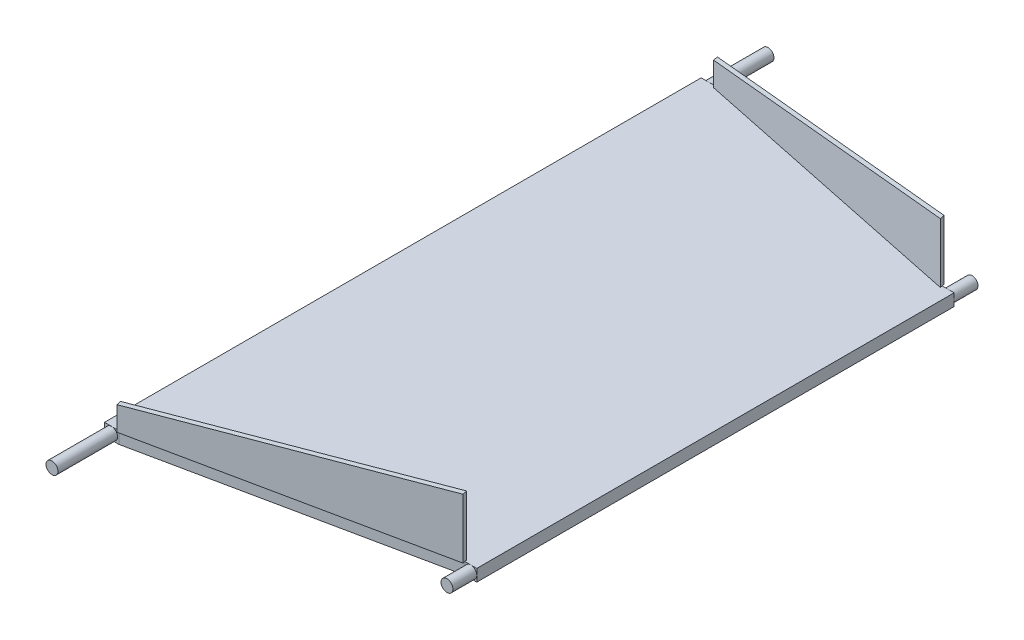
ISO-10303-21;
HEADER;
FILE_DESCRIPTION(('STEP AP214'),'2;1');
FILE_NAME('part.step','',(''),(''),'','','');
FILE_SCHEMA(('AUTOMOTIVE_DESIGN { 1 0 10303 214 1 1 1 1 }'));
ENDSEC;
DATA;
#1=APPLICATION_CONTEXT('core data for automotive mechanical design processes');
#2=APPLICATION_PROTOCOL_DEFINITION('international standard','automotive_design',2000,#1);
#3=PRODUCT_CONTEXT('',#1,'mechanical');
#4=PRODUCT('Part','Part','',(#3));
#5=PRODUCT_RELATED_PRODUCT_CATEGORY('part','',(#4));
#6=PRODUCT_DEFINITION_FORMATION('','',#4);
#7=PRODUCT_DEFINITION_CONTEXT('part definition',#1,'design');
#8=PRODUCT_DEFINITION('design','',#6,#7);
#9=PRODUCT_DEFINITION_SHAPE('','',#8);
#10=(LENGTH_UNIT() NAMED_UNIT(*) SI_UNIT(.MILLI.,.METRE.));
#11=(NAMED_UNIT(*) PLANE_ANGLE_UNIT() SI_UNIT($,.RADIAN.));
#12=(NAMED_UNIT(*) SI_UNIT($,.STERADIAN.) SOLID_ANGLE_UNIT());
#13=UNCERTAINTY_MEASURE_WITH_UNIT(LENGTH_MEASURE(1.E-05),#10,'distance_accuracy_value','');
#14=(GEOMETRIC_REPRESENTATION_CONTEXT(3) GLOBAL_UNCERTAINTY_ASSIGNED_CONTEXT((#13)) GLOBAL_UNIT_ASSIGNED_CONTEXT((#10,
#11,#12)) REPRESENTATION_CONTEXT('',''));
#15=CARTESIAN_POINT('',(0.,0.,0.));
#16=DIRECTION('',(0.,0.,1.));
#17=DIRECTION('',(1.,0.,0.));
#18=AXIS2_PLACEMENT_3D('',#15,#16,#17);
#19=CARTESIAN_POINT('',(0.,5.,0.));
#20=DIRECTION('',(0.,1.,0.));
#21=DIRECTION('',(0.,0.,1.));
#22=AXIS2_PLACEMENT_3D('',#19,#20,#21);
#23=PLANE('',#22);
#24=DIRECTION('',(0.978980419737605,0.,0.203954254112001));
#25=VECTOR('',#24,1.);
#26=CARTESIAN_POINT('',(-246.702913096708,5.,-101.869944420954));
#27=LINE('',#26,#25);
#28=CARTESIAN_POINT('',(-246.702913096708,5.,-101.869944420953));
#29=VERTEX_POINT('',#28);
#30=CARTESIAN_POINT('',(-126.702913096708,5.,-76.8699444209535));
#31=VERTEX_POINT('',#30);
#32=EDGE_CURVE('E62',#29,#31,#27,.T.);
#33=ORIENTED_EDGE('',*,*,#32,.F.);
#34=DIRECTION('',(0.203954254112001,0.,0.978980419737605));
#35=VECTOR('',#34,1.);
#36=CARTESIAN_POINT('',(-247.110821604932,5.,-103.827905260429));
#37=LINE('',#36,#35);
#38=CARTESIAN_POINT('',(-246.90686735082,5.,-102.848924840691));
#39=VERTEX_POINT('',#38);
#40=EDGE_CURVE('E237',#39,#29,#37,.T.);
#41=ORIENTED_EDGE('',*,*,#40,.F.);
#42=DIRECTION('',(-1.,0.,0.));
#43=VECTOR('',#42,1.);
#44=CARTESIAN_POINT('',(-246.90686735082,5.,-102.848924840691));
#45=LINE('',#44,#43);
#46=CARTESIAN_POINT('',(-249.90686735082,5.,-102.848924840691));
#47=VERTEX_POINT('',#46);
#48=EDGE_CURVE('E452',#39,#47,#45,.T.);
#49=ORIENTED_EDGE('',*,*,#48,.T.);
#50=CARTESIAN_POINT('',(-252.90686735082,5.,-102.848924840691));
#51=VERTEX_POINT('',#50);
#52=EDGE_CURVE('E449',#47,#51,#45,.T.);
#53=ORIENTED_EDGE('',*,*,#52,.T.);
#54=DIRECTION('',(0.,0.,1.));
#55=VECTOR('',#54,1.);
#56=CARTESIAN_POINT('',(-252.90686735082,5.,-102.848924840691));
#57=LINE('',#56,#55);
#58=CARTESIAN_POINT('',(-252.90686735082,5.,147.151075159309));
#59=VERTEX_POINT('',#58);
#60=EDGE_CURVE('E437',#51,#59,#57,.T.);
#61=ORIENTED_EDGE('',*,*,#60,.T.);
#62=DIRECTION('',(-1.,0.,0.));
#63=VECTOR('',#62,1.);
#64=CARTESIAN_POINT('',(-246.90686735082,5.,147.151075159309));
#65=LINE('',#64,#63);
#66=CARTESIAN_POINT('',(-249.90686735082,5.,147.151075159309));
#67=VERTEX_POINT('',#66);
#68=EDGE_CURVE('E420',#67,#59,#65,.T.);
#69=ORIENTED_EDGE('',*,*,#68,.F.);
#70=CARTESIAN_POINT('',(-246.90686735082,5.,147.151075159309));
#71=VERTEX_POINT('',#70);
#72=EDGE_CURVE('E423',#71,#67,#65,.T.);
#73=ORIENTED_EDGE('',*,*,#72,.F.);
#74=DIRECTION('',(0.203954254112001,0.,0.978980419737605));
#75=VECTOR('',#74,1.);
#76=CARTESIAN_POINT('',(-247.110821604932,5.,146.172094739571));
#77=LINE('',#76,#75);
#78=CARTESIAN_POINT('',(-247.110821604932,5.,146.172094739571));
#79=VERTEX_POINT('',#78);
#80=EDGE_CURVE('E242',#79,#71,#77,.T.);
#81=ORIENTED_EDGE('',*,*,#80,.F.);
#82=DIRECTION('',(0.978980419737605,0.,-0.203954254112001));
#83=VECTOR('',#82,1.);
#84=CARTESIAN_POINT('',(-247.110821604932,5.,146.172094739571));
#85=LINE('',#84,#83);
#86=CARTESIAN_POINT('',(-127.110821604932,5.,121.172094739571));
#87=VERTEX_POINT('',#86);
#88=EDGE_CURVE('E335',#79,#87,#85,.T.);
#89=ORIENTED_EDGE('',*,*,#88,.T.);
#90=DIRECTION('',(0.203954254112001,0.,0.978980419737605));
#91=VECTOR('',#90,1.);
#92=CARTESIAN_POINT('',(-127.110821604932,5.,121.172094739571));
#93=LINE('',#92,#91);
#94=CARTESIAN_POINT('',(-126.90686735082,5.,122.151075159309));
#95=VERTEX_POINT('',#94);
#96=EDGE_CURVE('E325',#87,#95,#93,.T.);
#97=ORIENTED_EDGE('',*,*,#96,.T.);
#98=DIRECTION('',(1.,0.,0.));
#99=VECTOR('',#98,1.);
#100=CARTESIAN_POINT('',(-126.90686735082,5.,122.151075159309));
#101=LINE('',#100,#99);
#102=CARTESIAN_POINT('',(-124.40686735082,5.,122.151075159309));
#103=VERTEX_POINT('',#102);
#104=EDGE_CURVE('E363',#95,#103,#101,.T.);
#105=ORIENTED_EDGE('',*,*,#104,.T.);
#106=CARTESIAN_POINT('',(-121.90686735082,5.,122.151075159309));
#107=VERTEX_POINT('',#106);
#108=EDGE_CURVE('E360',#103,#107,#101,.T.);
#109=ORIENTED_EDGE('',*,*,#108,.T.);
#110=DIRECTION('',(0.,0.,1.));
#111=VECTOR('',#110,1.);
#112=CARTESIAN_POINT('',(-121.90686735082,5.,122.151075159309));
#113=LINE('',#112,#111);
#114=CARTESIAN_POINT('',(-121.90686735082,5.,-77.8489248406911));
#115=VERTEX_POINT('',#114);
#116=EDGE_CURVE('E374',#115,#107,#113,.T.);
#117=ORIENTED_EDGE('',*,*,#116,.F.);
#118=DIRECTION('',(1.,0.,0.));
#119=VECTOR('',#118,1.);
#120=CARTESIAN_POINT('',(-126.90686735082,5.,-77.8489248406911));
#121=LINE('',#120,#119);
#122=CARTESIAN_POINT('',(-124.40686735082,5.,-77.8489248406911));
#123=VERTEX_POINT('',#122);
#124=EDGE_CURVE('E378',#123,#115,#121,.T.);
#125=ORIENTED_EDGE('',*,*,#124,.F.);
#126=CARTESIAN_POINT('',(-126.90686735082,5.,-77.8489248406911));
#127=VERTEX_POINT('',#126);
#128=EDGE_CURVE('E381',#127,#123,#121,.T.);
#129=ORIENTED_EDGE('',*,*,#128,.F.);
#130=DIRECTION('',(0.203954254112001,0.,0.978980419737605));
#131=VECTOR('',#130,1.);
#132=CARTESIAN_POINT('',(-127.110821604932,5.,-78.8279052604287));
#133=LINE('',#132,#131);
#134=EDGE_CURVE('E67',#127,#31,#133,.T.);
#135=ORIENTED_EDGE('',*,*,#134,.T.);
#136=EDGE_LOOP('',(#33,#41,#49,#53,#61,#69,#73,#81,#89,#97,#105,#109,#117,#125,#129,#135));
#137=FACE_BOUND('',#136,.T.);
#138=ADVANCED_FACE('F45',(#137),#23,.T.);
#139=CARTESIAN_POINT('',(-126.90686735082,0.,122.151075159309));
#140=DIRECTION('',(0.,0.,1.));
#141=DIRECTION('',(1.,0.,0.));
#142=AXIS2_PLACEMENT_3D('',#139,#140,#141);
#143=PLANE('',#142);
#144=DIRECTION('',(0.,-1.,0.));
#145=VECTOR('',#144,1.);
#146=CARTESIAN_POINT('',(-121.90686735082,0.,122.151075159309));
#147=LINE('',#146,#145);
#148=CARTESIAN_POINT('',(-121.90686735082,2.5,122.151075159309));
#149=VERTEX_POINT('',#148);
#150=CARTESIAN_POINT('',(-121.90686735082,0.,122.151075159309));
#151=VERTEX_POINT('',#150);
#152=EDGE_CURVE('E352',#149,#151,#147,.T.);
#153=ORIENTED_EDGE('',*,*,#152,.F.);
#154=CARTESIAN_POINT('',(-124.40686735082,2.5,122.151075159309));
#155=DIRECTION('',(0.,0.,1.));
#156=DIRECTION('',(1.,0.,0.));
#157=AXIS2_PLACEMENT_3D('',#154,#155,#156);
#158=CIRCLE('',#157,2.5);
#159=CARTESIAN_POINT('',(-124.40686735082,0.,122.151075159309));
#160=VERTEX_POINT('',#159);
#161=EDGE_CURVE('E12',#149,#160,#158,.F.);
#162=ORIENTED_EDGE('',*,*,#161,.T.);
#163=DIRECTION('',(1.,0.,0.));
#164=VECTOR('',#163,1.);
#165=CARTESIAN_POINT('',(-126.90686735082,0.,122.151075159309));
#166=LINE('',#165,#164);
#167=EDGE_CURVE('E367',#160,#151,#166,.T.);
#168=ORIENTED_EDGE('',*,*,#167,.T.);
#169=EDGE_LOOP('',(#153,#162,#168));
#170=FACE_BOUND('',#169,.T.);
#171=ADVANCED_FACE('F678',(#170),#143,.T.);
#172=CARTESIAN_POINT('',(-126.90686735082,0.,122.151075159309));
#173=VERTEX_POINT('',#172);
#174=EDGE_CURVE('E370',#173,#160,#166,.T.);
#175=ORIENTED_EDGE('',*,*,#174,.T.);
#176=CARTESIAN_POINT('',(-126.90686735082,2.5,122.151075159309));
#177=VERTEX_POINT('',#176);
#178=EDGE_CURVE('E55',#160,#177,#158,.F.);
#179=ORIENTED_EDGE('',*,*,#178,.T.);
#180=DIRECTION('',(0.,-1.,0.));
#181=VECTOR('',#180,1.);
#182=CARTESIAN_POINT('',(-126.90686735082,5.,122.151075159309));
#183=LINE('',#182,#181);
#184=EDGE_CURVE('E484',#177,#173,#183,.T.);
#185=ORIENTED_EDGE('',*,*,#184,.T.);
#186=EDGE_LOOP('',(#175,#179,#185));
#187=FACE_BOUND('',#186,.T.);
#188=ADVANCED_FACE('F628',(#187),#143,.T.);
#189=EDGE_CURVE('E487',#95,#177,#183,.T.);
#190=ORIENTED_EDGE('',*,*,#189,.T.);
#191=EDGE_CURVE('E518',#177,#103,#158,.F.);
#192=ORIENTED_EDGE('',*,*,#191,.T.);
#193=ORIENTED_EDGE('',*,*,#104,.F.);
#194=EDGE_LOOP('',(#190,#192,#193));
#195=FACE_BOUND('',#194,.T.);
#196=ADVANCED_FACE('F637',(#195),#143,.T.);
#197=CARTESIAN_POINT('',(-126.90686735082,0.,-77.8489248406911));
#198=DIRECTION('',(0.,0.,-1.));
#199=DIRECTION('',(-1.,0.,0.));
#200=AXIS2_PLACEMENT_3D('',#197,#198,#199);
#201=PLANE('',#200);
#202=DIRECTION('',(0.,-1.,0.));
#203=VECTOR('',#202,1.);
#204=CARTESIAN_POINT('',(-126.90686735082,5.,-77.8489248406911));
#205=LINE('',#204,#203);
#206=CARTESIAN_POINT('',(-126.90686735082,2.5,-77.8489248406911));
#207=VERTEX_POINT('',#206);
#208=CARTESIAN_POINT('',(-126.90686735082,0.,-77.8489248406911));
#209=VERTEX_POINT('',#208);
#210=EDGE_CURVE('E477',#207,#209,#205,.T.);
#211=ORIENTED_EDGE('',*,*,#210,.F.);
#212=CARTESIAN_POINT('',(-124.40686735082,2.5,-77.8489248406911));
#213=DIRECTION('',(0.,0.,-1.));
#214=DIRECTION('',(-1.,0.,0.));
#215=AXIS2_PLACEMENT_3D('',#212,#213,#214);
#216=CIRCLE('',#215,2.5);
#217=CARTESIAN_POINT('',(-124.40686735082,0.,-77.8489248406911));
#218=VERTEX_POINT('',#217);
#219=EDGE_CURVE('E514',#207,#218,#216,.F.);
#220=ORIENTED_EDGE('',*,*,#219,.T.);
#221=DIRECTION('',(1.,0.,0.));
#222=VECTOR('',#221,1.);
#223=CARTESIAN_POINT('',(-126.90686735082,0.,-77.8489248406911));
#224=LINE('',#223,#222);
#225=EDGE_CURVE('E396',#209,#218,#224,.T.);
#226=ORIENTED_EDGE('',*,*,#225,.F.);
#227=EDGE_LOOP('',(#211,#220,#226));
#228=FACE_BOUND('',#227,.T.);
#229=ADVANCED_FACE('F746',(#228),#201,.T.);
#230=CARTESIAN_POINT('',(-121.90686735082,0.,-77.8489248406911));
#231=VERTEX_POINT('',#230);
#232=EDGE_CURVE('E393',#218,#231,#224,.T.);
#233=ORIENTED_EDGE('',*,*,#232,.F.);
#234=CARTESIAN_POINT('',(-121.90686735082,2.5,-77.8489248406911));
#235=VERTEX_POINT('',#234);
#236=EDGE_CURVE('E510',#218,#235,#216,.F.);
#237=ORIENTED_EDGE('',*,*,#236,.T.);
#238=DIRECTION('',(0.,1.,0.));
#239=VECTOR('',#238,1.);
#240=CARTESIAN_POINT('',(-121.90686735082,0.,-77.8489248406911));
#241=LINE('',#240,#239);
#242=EDGE_CURVE('E389',#231,#235,#241,.T.);
#243=ORIENTED_EDGE('',*,*,#242,.F.);
#244=EDGE_LOOP('',(#233,#237,#243));
#245=FACE_BOUND('',#244,.T.);
#246=ADVANCED_FACE('F749',(#245),#201,.T.);
#247=EDGE_CURVE('E385',#235,#115,#241,.T.);
#248=ORIENTED_EDGE('',*,*,#247,.F.);
#249=EDGE_CURVE('E506',#235,#123,#216,.F.);
#250=ORIENTED_EDGE('',*,*,#249,.T.);
#251=ORIENTED_EDGE('',*,*,#124,.T.);
#252=EDGE_LOOP('',(#248,#250,#251));
#253=FACE_BOUND('',#252,.T.);
#254=ADVANCED_FACE('F752',(#253),#201,.T.);
#255=CARTESIAN_POINT('',(-246.90686735082,0.,-102.848924840691));
#256=DIRECTION('',(0.,0.,-1.));
#257=DIRECTION('',(-1.,0.,0.));
#258=AXIS2_PLACEMENT_3D('',#255,#256,#257);
#259=PLANE('',#258);
#260=ORIENTED_EDGE('',*,*,#52,.F.);
#261=CARTESIAN_POINT('',(-249.90686735082,2.5,-102.848924840691));
#262=DIRECTION('',(0.,0.,1.));
#263=DIRECTION('',(1.,0.,0.));
#264=AXIS2_PLACEMENT_3D('',#261,#262,#263);
#265=CIRCLE('',#264,2.5);
#266=CARTESIAN_POINT('',(-249.90686735082,0.,-102.848924840691));
#267=VERTEX_POINT('',#266);
#268=EDGE_CURVE('E404',#47,#267,#265,.T.);
#269=ORIENTED_EDGE('',*,*,#268,.T.);
#270=DIRECTION('',(-1.,0.,0.));
#271=VECTOR('',#270,1.);
#272=CARTESIAN_POINT('',(-246.90686735082,0.,-102.848924840691));
#273=LINE('',#272,#271);
#274=CARTESIAN_POINT('',(-252.90686735082,0.,-102.848924840691));
#275=VERTEX_POINT('',#274);
#276=EDGE_CURVE('E456',#267,#275,#273,.T.);
#277=ORIENTED_EDGE('',*,*,#276,.T.);
#278=DIRECTION('',(0.,1.,0.));
#279=VECTOR('',#278,1.);
#280=CARTESIAN_POINT('',(-252.90686735082,0.,-102.848924840691));
#281=LINE('',#280,#279);
#282=EDGE_CURVE('E441',#275,#51,#281,.T.);
#283=ORIENTED_EDGE('',*,*,#282,.T.);
#284=EDGE_LOOP('',(#260,#269,#277,#283));
#285=FACE_BOUND('',#284,.T.);
#286=ADVANCED_FACE('F727',(#285),#259,.T.);
#287=CARTESIAN_POINT('',(-246.90686735082,0.,147.151075159309));
#288=DIRECTION('',(0.,0.,-1.));
#289=DIRECTION('',(-1.,0.,0.));
#290=AXIS2_PLACEMENT_3D('',#287,#288,#289);
#291=PLANE('',#290);
#292=CARTESIAN_POINT('',(-249.90686735082,2.5,147.151075159309));
#293=DIRECTION('',(0.,0.,1.));
#294=DIRECTION('',(1.,0.,0.));
#295=AXIS2_PLACEMENT_3D('',#292,#293,#294);
#296=CIRCLE('',#295,2.5);
#297=CARTESIAN_POINT('',(-249.90686735082,0.,147.151075159309));
#298=VERTEX_POINT('',#297);
#299=EDGE_CURVE('E412',#67,#298,#296,.T.);
#300=ORIENTED_EDGE('',*,*,#299,.F.);
#301=ORIENTED_EDGE('',*,*,#68,.T.);
#302=DIRECTION('',(0.,1.,0.));
#303=VECTOR('',#302,1.);
#304=CARTESIAN_POINT('',(-252.90686735082,0.,147.151075159309));
#305=LINE('',#304,#303);
#306=CARTESIAN_POINT('',(-252.90686735082,0.,147.151075159309));
#307=VERTEX_POINT('',#306);
#308=EDGE_CURVE('E433',#307,#59,#305,.T.);
#309=ORIENTED_EDGE('',*,*,#308,.F.);
#310=DIRECTION('',(-1.,0.,0.));
#311=VECTOR('',#310,1.);
#312=CARTESIAN_POINT('',(-246.90686735082,0.,147.151075159309));
#313=LINE('',#312,#311);
#314=EDGE_CURVE('E426',#298,#307,#313,.T.);
#315=ORIENTED_EDGE('',*,*,#314,.F.);
#316=EDGE_LOOP('',(#300,#301,#309,#315));
#317=FACE_BOUND('',#316,.T.);
#318=ADVANCED_FACE('F722',(#317),#291,.F.);
#319=CARTESIAN_POINT('',(-246.90686735082,5.,-102.848924840691));
#320=DIRECTION('',(-0.203954254112001,0.,0.978980419737605));
#321=DIRECTION('',(0.978980419737605,0.,0.203954254112001));
#322=AXIS2_PLACEMENT_3D('',#319,#320,#321);
#323=PLANE('',#322);
#324=DIRECTION('',(-0.978980419737605,0.,-0.203954254112001));
#325=VECTOR('',#324,1.);
#326=CARTESIAN_POINT('',(-246.90686735082,0.,-102.848924840691));
#327=LINE('',#326,#325);
#328=CARTESIAN_POINT('',(-246.90686735082,0.,-102.848924840691));
#329=VERTEX_POINT('',#328);
#330=EDGE_CURVE('E463',#209,#329,#327,.T.);
#331=ORIENTED_EDGE('',*,*,#330,.T.);
#332=DIRECTION('',(0.,-1.,0.));
#333=VECTOR('',#332,1.);
#334=CARTESIAN_POINT('',(-246.90686735082,5.,-102.848924840691));
#335=LINE('',#334,#333);
#336=EDGE_CURVE('E494',#39,#329,#335,.T.);
#337=ORIENTED_EDGE('',*,*,#336,.F.);
#338=DIRECTION('',(-0.978980419737605,0.,-0.203954254112001));
#339=VECTOR('',#338,1.);
#340=CARTESIAN_POINT('',(-246.90686735082,5.,-102.848924840691));
#341=LINE('',#340,#339);
#342=EDGE_CURVE('E470',#127,#39,#341,.T.);
#343=ORIENTED_EDGE('',*,*,#342,.F.);
#344=EDGE_CURVE('E480',#127,#207,#205,.T.);
#345=ORIENTED_EDGE('',*,*,#344,.T.);
#346=ORIENTED_EDGE('',*,*,#210,.T.);
#347=EDGE_LOOP('',(#331,#337,#343,#345,#346));
#348=FACE_BOUND('',#347,.T.);
#349=ADVANCED_FACE('F47',(#348),#323,.F.);
#350=CARTESIAN_POINT('',(-246.90686735082,5.,147.151075159309));
#351=DIRECTION('',(-0.203954254112001,0.,-0.978980419737605));
#352=DIRECTION('',(-0.978980419737605,0.,0.203954254112001));
#353=AXIS2_PLACEMENT_3D('',#350,#351,#352);
#354=PLANE('',#353);
#355=DIRECTION('',(0.978980419737605,0.,-0.203954254112001));
#356=VECTOR('',#355,1.);
#357=CARTESIAN_POINT('',(-246.90686735082,0.,147.151075159309));
#358=LINE('',#357,#356);
#359=CARTESIAN_POINT('',(-246.90686735082,0.,147.151075159309));
#360=VERTEX_POINT('',#359);
#361=EDGE_CURVE('E466',#360,#173,#358,.T.);
#362=ORIENTED_EDGE('',*,*,#361,.T.);
#363=ORIENTED_EDGE('',*,*,#184,.F.);
#364=ORIENTED_EDGE('',*,*,#189,.F.);
#365=DIRECTION('',(0.978980419737605,0.,-0.203954254112001));
#366=VECTOR('',#365,1.);
#367=CARTESIAN_POINT('',(-246.90686735082,5.,147.151075159309));
#368=LINE('',#367,#366);
#369=EDGE_CURVE('E473',#71,#95,#368,.T.);
#370=ORIENTED_EDGE('',*,*,#369,.F.);
#371=DIRECTION('',(0.,-1.,0.));
#372=VECTOR('',#371,1.);
#373=CARTESIAN_POINT('',(-246.90686735082,5.,147.151075159309));
#374=LINE('',#373,#372);
#375=EDGE_CURVE('E491',#71,#360,#374,.T.);
#376=ORIENTED_EDGE('',*,*,#375,.T.);
#377=EDGE_LOOP('',(#362,#363,#364,#370,#376));
#378=FACE_BOUND('',#377,.T.);
#379=ADVANCED_FACE('F633',(#378),#354,.F.);
#380=CARTESIAN_POINT('',(0.,0.,0.));
#381=DIRECTION('',(0.,1.,0.));
#382=DIRECTION('',(0.,0.,1.));
#383=AXIS2_PLACEMENT_3D('',#380,#381,#382);
#384=PLANE('',#383);
#385=ORIENTED_EDGE('',*,*,#330,.F.);
#386=ORIENTED_EDGE('',*,*,#225,.T.);
#387=ORIENTED_EDGE('',*,*,#232,.T.);
#388=DIRECTION('',(0.,0.,-1.));
#389=VECTOR('',#388,1.);
#390=CARTESIAN_POINT('',(-121.90686735082,0.,122.151075159309));
#391=LINE('',#390,#389);
#392=EDGE_CURVE('E400',#151,#231,#391,.T.);
#393=ORIENTED_EDGE('',*,*,#392,.F.);
#394=ORIENTED_EDGE('',*,*,#167,.F.);
#395=ORIENTED_EDGE('',*,*,#174,.F.);
#396=ORIENTED_EDGE('',*,*,#361,.F.);
#397=EDGE_CURVE('E429',#360,#298,#313,.T.);
#398=ORIENTED_EDGE('',*,*,#397,.T.);
#399=ORIENTED_EDGE('',*,*,#314,.T.);
#400=DIRECTION('',(0.,0.,1.));
#401=VECTOR('',#400,1.);
#402=CARTESIAN_POINT('',(-252.90686735082,0.,-102.848924840691));
#403=LINE('',#402,#401);
#404=EDGE_CURVE('E445',#275,#307,#403,.T.);
#405=ORIENTED_EDGE('',*,*,#404,.F.);
#406=ORIENTED_EDGE('',*,*,#276,.F.);
#407=EDGE_CURVE('E459',#329,#267,#273,.T.);
#408=ORIENTED_EDGE('',*,*,#407,.F.);
#409=EDGE_LOOP('',(#385,#386,#387,#393,#394,#395,#396,#398,#399,#405,#406,#408));
#410=FACE_BOUND('',#409,.T.);
#411=ADVANCED_FACE('F673',(#410),#384,.F.);
#412=EDGE_CURVE('E498',#298,#67,#296,.T.);
#413=ORIENTED_EDGE('',*,*,#412,.F.);
#414=ORIENTED_EDGE('',*,*,#397,.F.);
#415=ORIENTED_EDGE('',*,*,#375,.F.);
#416=ORIENTED_EDGE('',*,*,#72,.T.);
#417=EDGE_LOOP('',(#413,#414,#415,#416));
#418=FACE_BOUND('',#417,.T.);
#419=ADVANCED_FACE('F668',(#418),#291,.F.);
#420=ORIENTED_EDGE('',*,*,#407,.T.);
#421=EDGE_CURVE('E502',#267,#47,#265,.T.);
#422=ORIENTED_EDGE('',*,*,#421,.T.);
#423=ORIENTED_EDGE('',*,*,#48,.F.);
#424=ORIENTED_EDGE('',*,*,#336,.T.);
#425=EDGE_LOOP('',(#420,#422,#423,#424));
#426=FACE_BOUND('',#425,.T.);
#427=ADVANCED_FACE('F713',(#426),#259,.T.);
#428=CARTESIAN_POINT('',(-252.90686735082,0.,-102.848924840691));
#429=DIRECTION('',(-1.,0.,0.));
#430=DIRECTION('',(0.,0.,1.));
#431=AXIS2_PLACEMENT_3D('',#428,#429,#430);
#432=PLANE('',#431);
#433=ORIENTED_EDGE('',*,*,#60,.F.);
#434=ORIENTED_EDGE('',*,*,#282,.F.);
#435=ORIENTED_EDGE('',*,*,#404,.T.);
#436=ORIENTED_EDGE('',*,*,#308,.T.);
#437=EDGE_LOOP('',(#433,#434,#435,#436));
#438=FACE_BOUND('',#437,.T.);
#439=ADVANCED_FACE('F716',(#438),#432,.T.);
#440=CARTESIAN_POINT('',(1.15648231731787E-13,0.,172.151075159309));
#441=DIRECTION('',(0.,0.,1.));
#442=DIRECTION('',(1.,0.,0.));
#443=AXIS2_PLACEMENT_3D('',#440,#441,#442);
#444=PLANE('',#443);
#445=CARTESIAN_POINT('',(-249.90686735082,2.5,172.151075159309));
#446=DIRECTION('',(0.,0.,1.));
#447=DIRECTION('',(1.,0.,0.));
#448=AXIS2_PLACEMENT_3D('',#445,#446,#447);
#449=CIRCLE('',#448,2.5);
#450=CARTESIAN_POINT('',(-247.40686735082,2.5,172.151075159309));
#451=VERTEX_POINT('',#450);
#452=EDGE_CURVE('E416',#451,#451,#449,.T.);
#453=ORIENTED_EDGE('',*,*,#452,.T.);
#454=EDGE_LOOP('',(#453));
#455=FACE_BOUND('',#454,.T.);
#456=ADVANCED_FACE('F772',(#455),#444,.T.);
#457=CARTESIAN_POINT('',(-249.90686735082,2.5,147.151075159309));
#458=DIRECTION('',(0.,0.,1.));
#459=DIRECTION('',(1.,0.,0.));
#460=AXIS2_PLACEMENT_3D('',#457,#458,#459);
#461=CYLINDRICAL_SURFACE('',#460,2.5);
#462=ORIENTED_EDGE('',*,*,#299,.T.);
#463=ORIENTED_EDGE('',*,*,#412,.T.);
#464=EDGE_LOOP('',(#462,#463));
#465=FACE_BOUND('',#464,.T.);
#466=ORIENTED_EDGE('',*,*,#452,.F.);
#467=EDGE_LOOP('',(#466));
#468=FACE_BOUND('',#467,.T.);
#469=ADVANCED_FACE('F776',(#465,#468),#461,.T.);
#470=CARTESIAN_POINT('',(0.,-5.92137874432052E-13,-127.848924840691));
#471=DIRECTION('',(0.,0.,-1.));
#472=DIRECTION('',(0.,1.,0.));
#473=AXIS2_PLACEMENT_3D('',#470,#471,#472);
#474=PLANE('',#473);
#475=CARTESIAN_POINT('',(-249.90686735082,2.5,-127.848924840691));
#476=DIRECTION('',(0.,0.,1.));
#477=DIRECTION('',(1.,0.,0.));
#478=AXIS2_PLACEMENT_3D('',#475,#476,#477);
#479=CIRCLE('',#478,2.5);
#480=CARTESIAN_POINT('',(-247.40686735082,2.5,-127.848924840691));
#481=VERTEX_POINT('',#480);
#482=EDGE_CURVE('E408',#481,#481,#479,.T.);
#483=ORIENTED_EDGE('',*,*,#482,.F.);
#484=EDGE_LOOP('',(#483));
#485=FACE_BOUND('',#484,.T.);
#486=ADVANCED_FACE('F761',(#485),#474,.T.);
#487=CARTESIAN_POINT('',(-249.90686735082,2.5,-102.848924840691));
#488=DIRECTION('',(0.,0.,-1.));
#489=DIRECTION('',(-1.,0.,0.));
#490=AXIS2_PLACEMENT_3D('',#487,#488,#489);
#491=CYLINDRICAL_SURFACE('',#490,2.5);
#492=ORIENTED_EDGE('',*,*,#268,.F.);
#493=ORIENTED_EDGE('',*,*,#421,.F.);
#494=EDGE_LOOP('',(#492,#493));
#495=FACE_BOUND('',#494,.T.);
#496=ORIENTED_EDGE('',*,*,#482,.T.);
#497=EDGE_LOOP('',(#496));
#498=FACE_BOUND('',#497,.T.);
#499=ADVANCED_FACE('F764',(#495,#498),#491,.T.);
#500=CARTESIAN_POINT('',(-121.90686735082,0.,0.));
#501=DIRECTION('',(-1.,0.,0.));
#502=DIRECTION('',(0.,0.,1.));
#503=AXIS2_PLACEMENT_3D('',#500,#501,#502);
#504=PLANE('',#503);
#505=ORIENTED_EDGE('',*,*,#392,.T.);
#506=ORIENTED_EDGE('',*,*,#242,.T.);
#507=ORIENTED_EDGE('',*,*,#247,.T.);
#508=ORIENTED_EDGE('',*,*,#116,.T.);
#509=EDGE_CURVE('E356',#107,#149,#147,.T.);
#510=ORIENTED_EDGE('',*,*,#509,.T.);
#511=ORIENTED_EDGE('',*,*,#152,.T.);
#512=EDGE_LOOP('',(#505,#506,#507,#508,#510,#511));
#513=FACE_BOUND('',#512,.T.);
#514=ADVANCED_FACE('F680',(#513),#504,.F.);
#515=ORIENTED_EDGE('',*,*,#108,.F.);
#516=CARTESIAN_POINT('',(-124.40686735082,2.5,122.151075159309));
#517=DIRECTION('',(0.,0.,1.));
#518=DIRECTION('',(1.,0.,0.));
#519=AXIS2_PLACEMENT_3D('',#516,#517,#518);
#520=CIRCLE('',#519,2.5);
#521=EDGE_CURVE('E338',#149,#103,#520,.T.);
#522=ORIENTED_EDGE('',*,*,#521,.F.);
#523=ORIENTED_EDGE('',*,*,#509,.F.);
#524=EDGE_LOOP('',(#515,#522,#523));
#525=FACE_BOUND('',#524,.T.);
#526=ADVANCED_FACE('F686',(#525),#143,.T.);
#527=ORIENTED_EDGE('',*,*,#128,.T.);
#528=CARTESIAN_POINT('',(-124.40686735082,2.5,-77.8489248406911));
#529=DIRECTION('',(0.,0.,-1.));
#530=DIRECTION('',(-1.,0.,0.));
#531=AXIS2_PLACEMENT_3D('',#528,#529,#530);
#532=CIRCLE('',#531,2.5);
#533=EDGE_CURVE('E345',#207,#123,#532,.T.);
#534=ORIENTED_EDGE('',*,*,#533,.F.);
#535=ORIENTED_EDGE('',*,*,#344,.F.);
#536=EDGE_LOOP('',(#527,#534,#535));
#537=FACE_BOUND('',#536,.T.);
#538=ADVANCED_FACE('F743',(#537),#201,.T.);
#539=CARTESIAN_POINT('',(-124.40686735082,2.5,-87.8489248406911));
#540=DIRECTION('',(0.,0.,1.));
#541=DIRECTION('',(1.,0.,0.));
#542=AXIS2_PLACEMENT_3D('',#539,#540,#541);
#543=CYLINDRICAL_SURFACE('',#542,2.5);
#544=CARTESIAN_POINT('',(-124.40686735082,2.5,-87.8489248406911));
#545=DIRECTION('',(0.,0.,-1.));
#546=DIRECTION('',(-1.,0.,0.));
#547=AXIS2_PLACEMENT_3D('',#544,#545,#546);
#548=CIRCLE('',#547,2.5);
#549=CARTESIAN_POINT('',(-126.90686735082,2.5,-87.8489248406911));
#550=VERTEX_POINT('',#549);
#551=EDGE_CURVE('E348',#550,#550,#548,.T.);
#552=ORIENTED_EDGE('',*,*,#551,.F.);
#553=EDGE_LOOP('',(#552));
#554=FACE_BOUND('',#553,.T.);
#555=ORIENTED_EDGE('',*,*,#533,.T.);
#556=ORIENTED_EDGE('',*,*,#249,.F.);
#557=ORIENTED_EDGE('',*,*,#236,.F.);
#558=ORIENTED_EDGE('',*,*,#219,.F.);
#559=EDGE_LOOP('',(#555,#556,#557,#558));
#560=FACE_BOUND('',#559,.T.);
#561=ADVANCED_FACE('F699',(#554,#560),#543,.T.);
#562=CARTESIAN_POINT('',(-124.40686735082,2.5,-87.8489248406911));
#563=DIRECTION('',(0.,0.,-1.));
#564=DIRECTION('',(-1.,0.,0.));
#565=AXIS2_PLACEMENT_3D('',#562,#563,#564);
#566=PLANE('',#565);
#567=ORIENTED_EDGE('',*,*,#551,.T.);
#568=EDGE_LOOP('',(#567));
#569=FACE_BOUND('',#568,.T.);
#570=ADVANCED_FACE('F690',(#569),#566,.T.);
#571=CARTESIAN_POINT('',(-124.40686735082,2.5,132.151075159309));
#572=DIRECTION('',(0.,0.,-1.));
#573=DIRECTION('',(-1.,0.,0.));
#574=AXIS2_PLACEMENT_3D('',#571,#572,#573);
#575=CYLINDRICAL_SURFACE('',#574,2.5);
#576=CARTESIAN_POINT('',(-124.40686735082,2.5,132.151075159309));
#577=DIRECTION('',(0.,0.,1.));
#578=DIRECTION('',(1.,0.,0.));
#579=AXIS2_PLACEMENT_3D('',#576,#577,#578);
#580=CIRCLE('',#579,2.5);
#581=CARTESIAN_POINT('',(-121.90686735082,2.5,132.151075159309));
#582=VERTEX_POINT('',#581);
#583=EDGE_CURVE('E341',#582,#582,#580,.T.);
#584=ORIENTED_EDGE('',*,*,#583,.F.);
#585=EDGE_LOOP('',(#584));
#586=FACE_BOUND('',#585,.T.);
#587=ORIENTED_EDGE('',*,*,#521,.T.);
#588=ORIENTED_EDGE('',*,*,#191,.F.);
#589=ORIENTED_EDGE('',*,*,#178,.F.);
#590=ORIENTED_EDGE('',*,*,#161,.F.);
#591=EDGE_LOOP('',(#587,#588,#589,#590));
#592=FACE_BOUND('',#591,.T.);
#593=ADVANCED_FACE('F687',(#586,#592),#575,.T.);
#594=CARTESIAN_POINT('',(-124.40686735082,2.5,132.151075159309));
#595=DIRECTION('',(0.,0.,1.));
#596=DIRECTION('',(1.,0.,0.));
#597=AXIS2_PLACEMENT_3D('',#594,#595,#596);
#598=PLANE('',#597);
#599=ORIENTED_EDGE('',*,*,#583,.T.);
#600=EDGE_LOOP('',(#599));
#601=FACE_BOUND('',#600,.T.);
#602=ADVANCED_FACE('F689',(#601),#598,.T.);
#603=CARTESIAN_POINT('',(-247.110821604932,5.,146.172094739571));
#604=DIRECTION('',(0.,-1.,0.));
#605=DIRECTION('',(0.,0.,-1.));
#606=AXIS2_PLACEMENT_3D('',#603,#604,#605);
#607=PLANE('',#606);
#608=ORIENTED_EDGE('',*,*,#369,.T.);
#609=CARTESIAN_POINT('',(-126.702913096708,5.,123.130055579046));
#610=VERTEX_POINT('',#609);
#611=EDGE_CURVE('E322',#95,#610,#93,.T.);
#612=ORIENTED_EDGE('',*,*,#611,.T.);
#613=DIRECTION('',(0.978980419737605,0.,-0.203954254112001));
#614=VECTOR('',#613,1.);
#615=CARTESIAN_POINT('',(-246.702913096708,5.,148.130055579046));
#616=LINE('',#615,#614);
#617=CARTESIAN_POINT('',(-246.702913096708,5.,148.130055579046));
#618=VERTEX_POINT('',#617);
#619=EDGE_CURVE('E331',#618,#610,#616,.T.);
#620=ORIENTED_EDGE('',*,*,#619,.F.);
#621=EDGE_CURVE('E294',#71,#618,#77,.T.);
#622=ORIENTED_EDGE('',*,*,#621,.F.);
#623=EDGE_LOOP('',(#608,#612,#620,#622));
#624=FACE_BOUND('',#623,.T.);
#625=ADVANCED_FACE('F642',(#624),#607,.T.);
#626=CARTESIAN_POINT('',(19.3145321831413,0.,92.7097544790781));
#627=DIRECTION('',(-0.203954254112001,0.,-0.978980419737605));
#628=DIRECTION('',(-0.978980419737605,0.,0.203954254112001));
#629=AXIS2_PLACEMENT_3D('',#626,#627,#628);
#630=PLANE('',#629);
#631=ORIENTED_EDGE('',*,*,#619,.T.);
#632=DIRECTION('',(0.,1.,0.));
#633=VECTOR('',#632,1.);
#634=CARTESIAN_POINT('',(-126.702913096708,5.,123.130055579046));
#635=LINE('',#634,#633);
#636=CARTESIAN_POINT('',(-126.702913096708,30.,123.130055579046));
#637=VERTEX_POINT('',#636);
#638=EDGE_CURVE('E318',#610,#637,#635,.T.);
#639=ORIENTED_EDGE('',*,*,#638,.T.);
#640=DIRECTION('',(0.971731596214699,0.121466449526837,-0.202444082544729));
#641=VECTOR('',#640,1.);
#642=CARTESIAN_POINT('',(-246.702913096708,15.,148.130055579046));
#643=LINE('',#642,#641);
#644=CARTESIAN_POINT('',(-246.702913096708,15.,148.130055579046));
#645=VERTEX_POINT('',#644);
#646=EDGE_CURVE('E307',#645,#637,#643,.T.);
#647=ORIENTED_EDGE('',*,*,#646,.F.);
#648=DIRECTION('',(0.,1.,0.));
#649=VECTOR('',#648,1.);
#650=CARTESIAN_POINT('',(-246.702913096708,5.,148.130055579046));
#651=LINE('',#650,#649);
#652=EDGE_CURVE('E209',#618,#645,#651,.T.);
#653=ORIENTED_EDGE('',*,*,#652,.F.);
#654=EDGE_LOOP('',(#631,#639,#647,#653));
#655=FACE_BOUND('',#654,.T.);
#656=ADVANCED_FACE('F653',(#655),#630,.F.);
#657=CARTESIAN_POINT('',(18.9066236749173,0.,90.7517936396029));
#658=DIRECTION('',(-0.203954254112001,0.,-0.978980419737605));
#659=DIRECTION('',(-0.978980419737605,0.,0.203954254112001));
#660=AXIS2_PLACEMENT_3D('',#657,#658,#659);
#661=PLANE('',#660);
#662=ORIENTED_EDGE('',*,*,#88,.F.);
#663=DIRECTION('',(0.,1.,0.));
#664=VECTOR('',#663,1.);
#665=CARTESIAN_POINT('',(-247.110821604932,5.,146.172094739571));
#666=LINE('',#665,#664);
#667=CARTESIAN_POINT('',(-247.110821604932,15.,146.172094739571));
#668=VERTEX_POINT('',#667);
#669=EDGE_CURVE('E300',#79,#668,#666,.T.);
#670=ORIENTED_EDGE('',*,*,#669,.T.);
#671=DIRECTION('',(0.971731596214699,0.121466449526837,-0.202444082544729));
#672=VECTOR('',#671,1.);
#673=CARTESIAN_POINT('',(-247.110821604932,15.,146.172094739571));
#674=LINE('',#673,#672);
#675=CARTESIAN_POINT('',(-127.110821604932,30.,121.172094739571));
#676=VERTEX_POINT('',#675);
#677=EDGE_CURVE('E310',#668,#676,#674,.T.);
#678=ORIENTED_EDGE('',*,*,#677,.T.);
#679=DIRECTION('',(0.,1.,0.));
#680=VECTOR('',#679,1.);
#681=CARTESIAN_POINT('',(-127.110821604932,5.,121.172094739571));
#682=LINE('',#681,#680);
#683=EDGE_CURVE('E328',#87,#676,#682,.T.);
#684=ORIENTED_EDGE('',*,*,#683,.F.);
#685=EDGE_LOOP('',(#662,#670,#678,#684));
#686=FACE_BOUND('',#685,.T.);
#687=ADVANCED_FACE('F663',(#686),#661,.T.);
#688=CARTESIAN_POINT('',(-247.110821604932,5.,146.172094739571));
#689=DIRECTION('',(0.978980419737605,0.,-0.203954254112001));
#690=DIRECTION('',(-0.203954254112001,0.,-0.978980419737605));
#691=AXIS2_PLACEMENT_3D('',#688,#689,#690);
#692=PLANE('',#691);
#693=ORIENTED_EDGE('',*,*,#652,.T.);
#694=DIRECTION('',(0.203954254112001,0.,0.978980419737605));
#695=VECTOR('',#694,1.);
#696=CARTESIAN_POINT('',(-247.110821604932,15.,146.172094739571));
#697=LINE('',#696,#695);
#698=EDGE_CURVE('E303',#668,#645,#697,.T.);
#699=ORIENTED_EDGE('',*,*,#698,.F.);
#700=ORIENTED_EDGE('',*,*,#669,.F.);
#701=ORIENTED_EDGE('',*,*,#80,.T.);
#702=ORIENTED_EDGE('',*,*,#621,.T.);
#703=EDGE_LOOP('',(#693,#699,#700,#701,#702));
#704=FACE_BOUND('',#703,.T.);
#705=ADVANCED_FACE('F656',(#704),#692,.F.);
#706=CARTESIAN_POINT('',(-247.110821604932,15.,146.172094739571));
#707=DIRECTION('',(0.11891327574182,-0.992595537789358,-0.0247735991128791));
#708=DIRECTION('',(0.99290027149669,0.118949782941367,0.));
#709=AXIS2_PLACEMENT_3D('',#706,#707,#708);
#710=PLANE('',#709);
#711=ORIENTED_EDGE('',*,*,#646,.T.);
#712=DIRECTION('',(0.203954254112001,0.,0.978980419737605));
#713=VECTOR('',#712,1.);
#714=CARTESIAN_POINT('',(-127.110821604932,30.,121.172094739571));
#715=LINE('',#714,#713);
#716=EDGE_CURVE('E314',#676,#637,#715,.T.);
#717=ORIENTED_EDGE('',*,*,#716,.F.);
#718=ORIENTED_EDGE('',*,*,#677,.F.);
#719=ORIENTED_EDGE('',*,*,#698,.T.);
#720=EDGE_LOOP('',(#711,#717,#718,#719));
#721=FACE_BOUND('',#720,.T.);
#722=ADVANCED_FACE('F659',(#721),#710,.F.);
#723=CARTESIAN_POINT('',(-127.110821604932,5.,121.172094739571));
#724=DIRECTION('',(0.978980419737605,0.,-0.203954254112001));
#725=DIRECTION('',(-0.203954254112001,0.,-0.978980419737605));
#726=AXIS2_PLACEMENT_3D('',#723,#724,#725);
#727=PLANE('',#726);
#728=ORIENTED_EDGE('',*,*,#638,.F.);
#729=ORIENTED_EDGE('',*,*,#611,.F.);
#730=ORIENTED_EDGE('',*,*,#96,.F.);
#731=ORIENTED_EDGE('',*,*,#683,.T.);
#732=ORIENTED_EDGE('',*,*,#716,.T.);
#733=EDGE_LOOP('',(#728,#729,#730,#731,#732));
#734=FACE_BOUND('',#733,.T.);
#735=ADVANCED_FACE('F648',(#734),#727,.T.);
#736=CARTESIAN_POINT('',(-247.110821604932,5.,-103.827905260429));
#737=DIRECTION('',(0.,-1.,0.));
#738=DIRECTION('',(0.,0.,-1.));
#739=AXIS2_PLACEMENT_3D('',#736,#737,#738);
#740=PLANE('',#739);
#741=ORIENTED_EDGE('',*,*,#342,.T.);
#742=CARTESIAN_POINT('',(-247.110821604932,5.,-103.827905260429));
#743=VERTEX_POINT('',#742);
#744=EDGE_CURVE('E205',#743,#39,#37,.T.);
#745=ORIENTED_EDGE('',*,*,#744,.F.);
#746=DIRECTION('',(0.978980419737605,0.,0.203954254112001));
#747=VECTOR('',#746,1.);
#748=CARTESIAN_POINT('',(-247.110821604932,5.,-103.827905260429));
#749=LINE('',#748,#747);
#750=CARTESIAN_POINT('',(-127.110821604932,5.,-78.8279052604287));
#751=VERTEX_POINT('',#750);
#752=EDGE_CURVE('E198',#743,#751,#749,.T.);
#753=ORIENTED_EDGE('',*,*,#752,.T.);
#754=EDGE_CURVE('E203',#751,#127,#133,.T.);
#755=ORIENTED_EDGE('',*,*,#754,.T.);
#756=EDGE_LOOP('',(#741,#745,#753,#755));
#757=FACE_BOUND('',#756,.T.);
#758=ADVANCED_FACE('F201',(#757),#740,.T.);
#759=CARTESIAN_POINT('',(10.8597855317317,-2.46069544008145E-13,-48.2110488733616));
#760=DIRECTION('',(0.203954254112001,0.,-0.978980419737605));
#761=DIRECTION('',(-0.978980419737605,0.,-0.203954254112001));
#762=AXIS2_PLACEMENT_3D('',#759,#760,#761);
#763=PLANE('',#762);
#764=ORIENTED_EDGE('',*,*,#32,.T.);
#765=DIRECTION('',(0.,1.,0.));
#766=VECTOR('',#765,1.);
#767=CARTESIAN_POINT('',(-126.702913096708,5.,-76.8699444209535));
#768=LINE('',#767,#766);
#769=CARTESIAN_POINT('',(-126.702913096708,30.,-76.8699444209535));
#770=VERTEX_POINT('',#769);
#771=EDGE_CURVE('E224',#31,#770,#768,.T.);
#772=ORIENTED_EDGE('',*,*,#771,.T.);
#773=DIRECTION('',(0.971731596214699,0.121466449526837,0.202444082544729));
#774=VECTOR('',#773,1.);
#775=CARTESIAN_POINT('',(-246.702913096708,15.,-101.869944420954));
#776=LINE('',#775,#774);
#777=CARTESIAN_POINT('',(-246.702913096708,15.,-101.869944420954));
#778=VERTEX_POINT('',#777);
#779=EDGE_CURVE('E258',#778,#770,#776,.T.);
#780=ORIENTED_EDGE('',*,*,#779,.F.);
#781=DIRECTION('',(0.,1.,0.));
#782=VECTOR('',#781,1.);
#783=CARTESIAN_POINT('',(-246.702913096708,5.,-101.869944420954));
#784=LINE('',#783,#782);
#785=EDGE_CURVE('E241',#29,#778,#784,.T.);
#786=ORIENTED_EDGE('',*,*,#785,.F.);
#787=EDGE_LOOP('',(#764,#772,#780,#786));
#788=FACE_BOUND('',#787,.T.);
#789=ADVANCED_FACE('F268',(#788),#763,.F.);
#790=CARTESIAN_POINT('',(10.4518770235077,-2.46069544008145E-13,-50.1690097128369));
#791=DIRECTION('',(0.203954254112001,0.,-0.978980419737605));
#792=DIRECTION('',(-0.978980419737605,0.,-0.203954254112001));
#793=AXIS2_PLACEMENT_3D('',#790,#791,#792);
#794=PLANE('',#793);
#795=ORIENTED_EDGE('',*,*,#752,.F.);
#796=DIRECTION('',(0.,1.,0.));
#797=VECTOR('',#796,1.);
#798=CARTESIAN_POINT('',(-247.110821604932,5.,-103.827905260429));
#799=LINE('',#798,#797);
#800=CARTESIAN_POINT('',(-247.110821604932,15.,-103.827905260429));
#801=VERTEX_POINT('',#800);
#802=EDGE_CURVE('E250',#743,#801,#799,.T.);
#803=ORIENTED_EDGE('',*,*,#802,.T.);
#804=DIRECTION('',(0.971731596214699,0.121466449526837,0.202444082544729));
#805=VECTOR('',#804,1.);
#806=CARTESIAN_POINT('',(-247.110821604932,15.,-103.827905260429));
#807=LINE('',#806,#805);
#808=CARTESIAN_POINT('',(-127.110821604932,30.,-78.8279052604287));
#809=VERTEX_POINT('',#808);
#810=EDGE_CURVE('E214',#801,#809,#807,.T.);
#811=ORIENTED_EDGE('',*,*,#810,.T.);
#812=DIRECTION('',(0.,1.,0.));
#813=VECTOR('',#812,1.);
#814=CARTESIAN_POINT('',(-127.110821604932,5.,-78.8279052604287));
#815=LINE('',#814,#813);
#816=EDGE_CURVE('E212',#751,#809,#815,.T.);
#817=ORIENTED_EDGE('',*,*,#816,.F.);
#818=EDGE_LOOP('',(#795,#803,#811,#817));
#819=FACE_BOUND('',#818,.T.);
#820=ADVANCED_FACE('F213',(#819),#794,.T.);
#821=CARTESIAN_POINT('',(-247.110821604932,5.,-103.827905260429));
#822=DIRECTION('',(0.978980419737605,0.,-0.203954254112001));
#823=DIRECTION('',(-0.203954254112001,0.,-0.978980419737605));
#824=AXIS2_PLACEMENT_3D('',#821,#822,#823);
#825=PLANE('',#824);
#826=ORIENTED_EDGE('',*,*,#785,.T.);
#827=DIRECTION('',(0.203954254112001,0.,0.978980419737605));
#828=VECTOR('',#827,1.);
#829=CARTESIAN_POINT('',(-247.110821604932,15.,-103.827905260429));
#830=LINE('',#829,#828);
#831=EDGE_CURVE('E253',#801,#778,#830,.T.);
#832=ORIENTED_EDGE('',*,*,#831,.F.);
#833=ORIENTED_EDGE('',*,*,#802,.F.);
#834=ORIENTED_EDGE('',*,*,#744,.T.);
#835=ORIENTED_EDGE('',*,*,#40,.T.);
#836=EDGE_LOOP('',(#826,#832,#833,#834,#835));
#837=FACE_BOUND('',#836,.T.);
#838=ADVANCED_FACE('F260',(#837),#825,.F.);
#839=CARTESIAN_POINT('',(-247.110821604932,15.,-103.827905260429));
#840=DIRECTION('',(0.129522801511752,-0.991209217124658,-0.026983916981615));
#841=DIRECTION('',(0.991570279776181,0.129569982112314,0.));
#842=AXIS2_PLACEMENT_3D('',#839,#840,#841);
#843=PLANE('',#842);
#844=ORIENTED_EDGE('',*,*,#779,.T.);
#845=DIRECTION('',(0.203954254112001,0.,0.978980419737605));
#846=VECTOR('',#845,1.);
#847=CARTESIAN_POINT('',(-127.110821604932,30.,-78.8279052604287));
#848=LINE('',#847,#846);
#849=EDGE_CURVE('E272',#809,#770,#848,.T.);
#850=ORIENTED_EDGE('',*,*,#849,.F.);
#851=ORIENTED_EDGE('',*,*,#810,.F.);
#852=ORIENTED_EDGE('',*,*,#831,.T.);
#853=EDGE_LOOP('',(#844,#850,#851,#852));
#854=FACE_BOUND('',#853,.T.);
#855=ADVANCED_FACE('F265',(#854),#843,.F.);
#856=CARTESIAN_POINT('',(-127.110821604932,5.,-78.8279052604287));
#857=DIRECTION('',(0.978980419737605,0.,-0.203954254112001));
#858=DIRECTION('',(-0.203954254112001,0.,-0.978980419737605));
#859=AXIS2_PLACEMENT_3D('',#856,#857,#858);
#860=PLANE('',#859);
#861=ORIENTED_EDGE('',*,*,#771,.F.);
#862=ORIENTED_EDGE('',*,*,#134,.F.);
#863=ORIENTED_EDGE('',*,*,#754,.F.);
#864=ORIENTED_EDGE('',*,*,#816,.T.);
#865=ORIENTED_EDGE('',*,*,#849,.T.);
#866=EDGE_LOOP('',(#861,#862,#863,#864,#865));
#867=FACE_BOUND('',#866,.T.);
#868=ADVANCED_FACE('F220',(#867),#860,.T.);
#869=CLOSED_SHELL('',(#138,#171,#188,#196,#229,#246,#254,#286,#318,#349,#379,#411,#419,#427,
#439,#456,#469,#486,#499,#514,#526,#538,#561,#570,#593,#602,#625,#656,#687,#705,#722,#735,#758,
#789,#820,#838,#855,#868));
#870=MANIFOLD_SOLID_BREP('B2',#869);
#871=ADVANCED_BREP_SHAPE_REPRESENTATION('',(#18,#870),#14);
#872=SHAPE_DEFINITION_REPRESENTATION(#9,#871);
ENDSEC;
END-ISO-10303-21;
